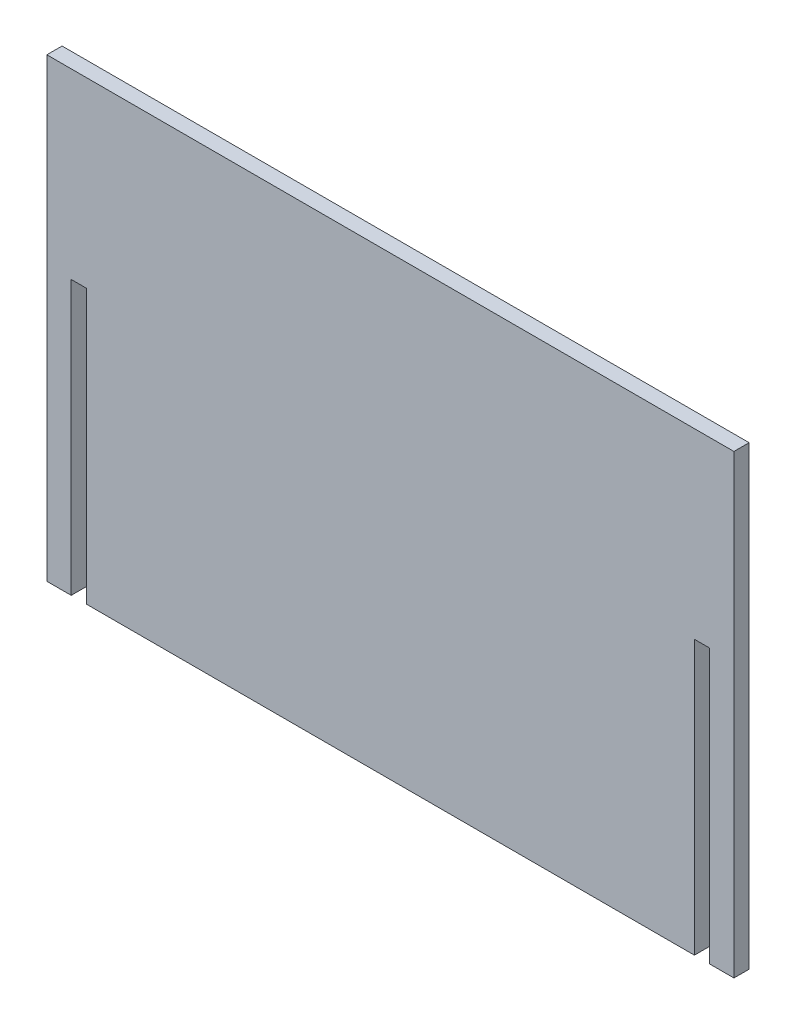
ISO-10303-21;
HEADER;
FILE_DESCRIPTION(('STEP AP214'),'2;1');
FILE_NAME('part.step','',(''),(''),'','','');
FILE_SCHEMA(('AUTOMOTIVE_DESIGN { 1 0 10303 214 1 1 1 1 }'));
ENDSEC;
DATA;
#1=APPLICATION_CONTEXT('core data for automotive mechanical design processes');
#2=APPLICATION_PROTOCOL_DEFINITION('international standard','automotive_design',2000,#1);
#3=PRODUCT_CONTEXT('',#1,'mechanical');
#4=PRODUCT('Part','Part','',(#3));
#5=PRODUCT_RELATED_PRODUCT_CATEGORY('part','',(#4));
#6=PRODUCT_DEFINITION_FORMATION('','',#4);
#7=PRODUCT_DEFINITION_CONTEXT('part definition',#1,'design');
#8=PRODUCT_DEFINITION('design','',#6,#7);
#9=PRODUCT_DEFINITION_SHAPE('','',#8);
#10=(LENGTH_UNIT() NAMED_UNIT(*) SI_UNIT(.MILLI.,.METRE.));
#11=(NAMED_UNIT(*) PLANE_ANGLE_UNIT() SI_UNIT($,.RADIAN.));
#12=(NAMED_UNIT(*) SI_UNIT($,.STERADIAN.) SOLID_ANGLE_UNIT());
#13=UNCERTAINTY_MEASURE_WITH_UNIT(LENGTH_MEASURE(1.E-05),#10,'distance_accuracy_value','');
#14=(GEOMETRIC_REPRESENTATION_CONTEXT(3) GLOBAL_UNCERTAINTY_ASSIGNED_CONTEXT((#13)) GLOBAL_UNIT_ASSIGNED_CONTEXT((#10,
#11,#12)) REPRESENTATION_CONTEXT('',''));
#15=CARTESIAN_POINT('',(0.,0.,0.));
#16=DIRECTION('',(0.,0.,1.));
#17=DIRECTION('',(1.,0.,0.));
#18=AXIS2_PLACEMENT_3D('',#15,#16,#17);
#19=CARTESIAN_POINT('',(8.,0.,5.));
#20=DIRECTION('',(0.,-1.,0.));
#21=DIRECTION('',(0.,0.,-1.));
#22=AXIS2_PLACEMENT_3D('',#19,#20,#21);
#23=PLANE('',#22);
#24=DIRECTION('',(-1.,0.,0.));
#25=VECTOR('',#24,1.);
#26=CARTESIAN_POINT('',(8.,0.,0.));
#27=LINE('',#26,#25);
#28=CARTESIAN_POINT('',(8.,0.,0.));
#29=VERTEX_POINT('',#28);
#30=CARTESIAN_POINT('',(0.,0.,0.));
#31=VERTEX_POINT('',#30);
#32=EDGE_CURVE('E154',#29,#31,#27,.T.);
#33=ORIENTED_EDGE('',*,*,#32,.F.);
#34=DIRECTION('',(0.,0.,-1.));
#35=VECTOR('',#34,1.);
#36=CARTESIAN_POINT('',(8.,0.,5.));
#37=LINE('',#36,#35);
#38=CARTESIAN_POINT('',(8.,0.,5.));
#39=VERTEX_POINT('',#38);
#40=EDGE_CURVE('E11',#39,#29,#37,.T.);
#41=ORIENTED_EDGE('',*,*,#40,.F.);
#42=DIRECTION('',(-1.,0.,0.));
#43=VECTOR('',#42,1.);
#44=CARTESIAN_POINT('',(8.,0.,5.));
#45=LINE('',#44,#43);
#46=CARTESIAN_POINT('',(0.,0.,5.));
#47=VERTEX_POINT('',#46);
#48=EDGE_CURVE('E186',#39,#47,#45,.T.);
#49=ORIENTED_EDGE('',*,*,#48,.T.);
#50=DIRECTION('',(0.,0.,-1.));
#51=VECTOR('',#50,1.);
#52=CARTESIAN_POINT('',(0.,0.,5.));
#53=LINE('',#52,#51);
#54=EDGE_CURVE('E36',#47,#31,#53,.T.);
#55=ORIENTED_EDGE('',*,*,#54,.T.);
#56=EDGE_LOOP('',(#33,#41,#49,#55));
#57=FACE_BOUND('',#56,.T.);
#58=ADVANCED_FACE('F33',(#57),#23,.T.);
#59=CARTESIAN_POINT('',(7.99999999999999,90.,5.));
#60=DIRECTION('',(1.,0.,0.));
#61=DIRECTION('',(0.,1.,0.));
#62=AXIS2_PLACEMENT_3D('',#59,#60,#61);
#63=PLANE('',#62);
#64=DIRECTION('',(0.,-1.,0.));
#65=VECTOR('',#64,1.);
#66=CARTESIAN_POINT('',(7.99999999999999,90.,0.));
#67=LINE('',#66,#65);
#68=CARTESIAN_POINT('',(7.99999999999999,90.,0.));
#69=VERTEX_POINT('',#68);
#70=EDGE_CURVE('E184',#69,#29,#67,.T.);
#71=ORIENTED_EDGE('',*,*,#70,.F.);
#72=DIRECTION('',(0.,0.,-1.));
#73=VECTOR('',#72,1.);
#74=CARTESIAN_POINT('',(7.99999999999999,90.,5.));
#75=LINE('',#74,#73);
#76=CARTESIAN_POINT('',(7.99999999999999,90.,5.));
#77=VERTEX_POINT('',#76);
#78=EDGE_CURVE('E42',#77,#69,#75,.T.);
#79=ORIENTED_EDGE('',*,*,#78,.F.);
#80=DIRECTION('',(0.,-1.,0.));
#81=VECTOR('',#80,1.);
#82=CARTESIAN_POINT('',(7.99999999999999,90.,5.));
#83=LINE('',#82,#81);
#84=EDGE_CURVE('E144',#77,#39,#83,.T.);
#85=ORIENTED_EDGE('',*,*,#84,.T.);
#86=ORIENTED_EDGE('',*,*,#40,.T.);
#87=EDGE_LOOP('',(#71,#79,#85,#86));
#88=FACE_BOUND('',#87,.T.);
#89=ADVANCED_FACE('F206',(#88),#63,.T.);
#90=CARTESIAN_POINT('',(13.,90.,5.));
#91=DIRECTION('',(0.,-1.,0.));
#92=DIRECTION('',(0.,0.,-1.));
#93=AXIS2_PLACEMENT_3D('',#90,#91,#92);
#94=PLANE('',#93);
#95=DIRECTION('',(-1.,0.,0.));
#96=VECTOR('',#95,1.);
#97=CARTESIAN_POINT('',(13.,90.,0.));
#98=LINE('',#97,#96);
#99=CARTESIAN_POINT('',(13.,90.,0.));
#100=VERTEX_POINT('',#99);
#101=EDGE_CURVE('E131',#100,#69,#98,.T.);
#102=ORIENTED_EDGE('',*,*,#101,.F.);
#103=DIRECTION('',(0.,0.,-1.));
#104=VECTOR('',#103,1.);
#105=CARTESIAN_POINT('',(13.,90.,5.));
#106=LINE('',#105,#104);
#107=CARTESIAN_POINT('',(13.,90.,5.));
#108=VERTEX_POINT('',#107);
#109=EDGE_CURVE('E126',#108,#100,#106,.T.);
#110=ORIENTED_EDGE('',*,*,#109,.F.);
#111=DIRECTION('',(-1.,0.,0.));
#112=VECTOR('',#111,1.);
#113=CARTESIAN_POINT('',(13.,90.,5.));
#114=LINE('',#113,#112);
#115=EDGE_CURVE('E129',#108,#77,#114,.T.);
#116=ORIENTED_EDGE('',*,*,#115,.T.);
#117=ORIENTED_EDGE('',*,*,#78,.T.);
#118=EDGE_LOOP('',(#102,#110,#116,#117));
#119=FACE_BOUND('',#118,.T.);
#120=ADVANCED_FACE('F128',(#119),#94,.T.);
#121=CARTESIAN_POINT('',(13.,0.,5.));
#122=DIRECTION('',(-1.,0.,0.));
#123=DIRECTION('',(0.,-1.,0.));
#124=AXIS2_PLACEMENT_3D('',#121,#122,#123);
#125=PLANE('',#124);
#126=DIRECTION('',(0.,1.,0.));
#127=VECTOR('',#126,1.);
#128=CARTESIAN_POINT('',(13.,0.,0.));
#129=LINE('',#128,#127);
#130=CARTESIAN_POINT('',(13.,0.,0.));
#131=VERTEX_POINT('',#130);
#132=EDGE_CURVE('E181',#131,#100,#129,.T.);
#133=ORIENTED_EDGE('',*,*,#132,.F.);
#134=DIRECTION('',(0.,0.,-1.));
#135=VECTOR('',#134,1.);
#136=CARTESIAN_POINT('',(13.,0.,5.));
#137=LINE('',#136,#135);
#138=CARTESIAN_POINT('',(13.,0.,5.));
#139=VERTEX_POINT('',#138);
#140=EDGE_CURVE('E136',#139,#131,#137,.T.);
#141=ORIENTED_EDGE('',*,*,#140,.F.);
#142=DIRECTION('',(0.,1.,0.));
#143=VECTOR('',#142,1.);
#144=CARTESIAN_POINT('',(13.,0.,5.));
#145=LINE('',#144,#143);
#146=EDGE_CURVE('E142',#139,#108,#145,.T.);
#147=ORIENTED_EDGE('',*,*,#146,.T.);
#148=ORIENTED_EDGE('',*,*,#109,.T.);
#149=EDGE_LOOP('',(#133,#141,#147,#148));
#150=FACE_BOUND('',#149,.T.);
#151=ADVANCED_FACE('F146',(#150),#125,.T.);
#152=CARTESIAN_POINT('',(213.,0.,5.));
#153=DIRECTION('',(0.,-1.,0.));
#154=DIRECTION('',(1.,0.,0.));
#155=AXIS2_PLACEMENT_3D('',#152,#153,#154);
#156=PLANE('',#155);
#157=DIRECTION('',(-1.,0.,0.));
#158=VECTOR('',#157,1.);
#159=CARTESIAN_POINT('',(213.,0.,0.));
#160=LINE('',#159,#158);
#161=CARTESIAN_POINT('',(213.,0.,0.));
#162=VERTEX_POINT('',#161);
#163=EDGE_CURVE('E178',#162,#131,#160,.T.);
#164=ORIENTED_EDGE('',*,*,#163,.F.);
#165=DIRECTION('',(0.,0.,-1.));
#166=VECTOR('',#165,1.);
#167=CARTESIAN_POINT('',(213.,0.,5.));
#168=LINE('',#167,#166);
#169=CARTESIAN_POINT('',(213.,0.,5.));
#170=VERTEX_POINT('',#169);
#171=EDGE_CURVE('E190',#170,#162,#168,.T.);
#172=ORIENTED_EDGE('',*,*,#171,.F.);
#173=DIRECTION('',(-1.,0.,0.));
#174=VECTOR('',#173,1.);
#175=CARTESIAN_POINT('',(213.,0.,5.));
#176=LINE('',#175,#174);
#177=EDGE_CURVE('E147',#170,#139,#176,.T.);
#178=ORIENTED_EDGE('',*,*,#177,.T.);
#179=ORIENTED_EDGE('',*,*,#140,.T.);
#180=EDGE_LOOP('',(#164,#172,#178,#179));
#181=FACE_BOUND('',#180,.T.);
#182=ADVANCED_FACE('F219',(#181),#156,.T.);
#183=CARTESIAN_POINT('',(213.,90.,5.));
#184=DIRECTION('',(1.,0.,0.));
#185=DIRECTION('',(0.,0.,-1.));
#186=AXIS2_PLACEMENT_3D('',#183,#184,#185);
#187=PLANE('',#186);
#188=DIRECTION('',(0.,-1.,0.));
#189=VECTOR('',#188,1.);
#190=CARTESIAN_POINT('',(213.,90.,0.));
#191=LINE('',#190,#189);
#192=CARTESIAN_POINT('',(213.,90.,0.));
#193=VERTEX_POINT('',#192);
#194=EDGE_CURVE('E175',#193,#162,#191,.T.);
#195=ORIENTED_EDGE('',*,*,#194,.F.);
#196=DIRECTION('',(0.,0.,-1.));
#197=VECTOR('',#196,1.);
#198=CARTESIAN_POINT('',(213.,90.,5.));
#199=LINE('',#198,#197);
#200=CARTESIAN_POINT('',(213.,90.,5.));
#201=VERTEX_POINT('',#200);
#202=EDGE_CURVE('E192',#201,#193,#199,.T.);
#203=ORIENTED_EDGE('',*,*,#202,.F.);
#204=DIRECTION('',(0.,-1.,0.));
#205=VECTOR('',#204,1.);
#206=CARTESIAN_POINT('',(213.,90.,5.));
#207=LINE('',#206,#205);
#208=EDGE_CURVE('E149',#201,#170,#207,.T.);
#209=ORIENTED_EDGE('',*,*,#208,.T.);
#210=ORIENTED_EDGE('',*,*,#171,.T.);
#211=EDGE_LOOP('',(#195,#203,#209,#210));
#212=FACE_BOUND('',#211,.T.);
#213=ADVANCED_FACE('F222',(#212),#187,.T.);
#214=CARTESIAN_POINT('',(218.,90.,5.));
#215=DIRECTION('',(0.,-1.,0.));
#216=DIRECTION('',(1.,0.,0.));
#217=AXIS2_PLACEMENT_3D('',#214,#215,#216);
#218=PLANE('',#217);
#219=DIRECTION('',(-1.,0.,0.));
#220=VECTOR('',#219,1.);
#221=CARTESIAN_POINT('',(218.,90.,0.));
#222=LINE('',#221,#220);
#223=CARTESIAN_POINT('',(218.,90.,0.));
#224=VERTEX_POINT('',#223);
#225=EDGE_CURVE('E172',#224,#193,#222,.T.);
#226=ORIENTED_EDGE('',*,*,#225,.F.);
#227=DIRECTION('',(0.,0.,-1.));
#228=VECTOR('',#227,1.);
#229=CARTESIAN_POINT('',(218.,90.,5.));
#230=LINE('',#229,#228);
#231=CARTESIAN_POINT('',(218.,90.,5.));
#232=VERTEX_POINT('',#231);
#233=EDGE_CURVE('E194',#232,#224,#230,.T.);
#234=ORIENTED_EDGE('',*,*,#233,.F.);
#235=DIRECTION('',(-1.,0.,0.));
#236=VECTOR('',#235,1.);
#237=CARTESIAN_POINT('',(218.,90.,5.));
#238=LINE('',#237,#236);
#239=EDGE_CURVE('E348',#232,#201,#238,.T.);
#240=ORIENTED_EDGE('',*,*,#239,.T.);
#241=ORIENTED_EDGE('',*,*,#202,.T.);
#242=EDGE_LOOP('',(#226,#234,#240,#241));
#243=FACE_BOUND('',#242,.T.);
#244=ADVANCED_FACE('F226',(#243),#218,.T.);
#245=CARTESIAN_POINT('',(218.,0.,5.));
#246=DIRECTION('',(-1.,0.,0.));
#247=DIRECTION('',(0.,0.,1.));
#248=AXIS2_PLACEMENT_3D('',#245,#246,#247);
#249=PLANE('',#248);
#250=DIRECTION('',(0.,1.,0.));
#251=VECTOR('',#250,1.);
#252=CARTESIAN_POINT('',(218.,0.,0.));
#253=LINE('',#252,#251);
#254=CARTESIAN_POINT('',(218.,0.,0.));
#255=VERTEX_POINT('',#254);
#256=EDGE_CURVE('E169',#255,#224,#253,.T.);
#257=ORIENTED_EDGE('',*,*,#256,.F.);
#258=DIRECTION('',(0.,0.,-1.));
#259=VECTOR('',#258,1.);
#260=CARTESIAN_POINT('',(218.,0.,5.));
#261=LINE('',#260,#259);
#262=CARTESIAN_POINT('',(218.,0.,5.));
#263=VERTEX_POINT('',#262);
#264=EDGE_CURVE('E196',#263,#255,#261,.T.);
#265=ORIENTED_EDGE('',*,*,#264,.F.);
#266=DIRECTION('',(0.,1.,0.));
#267=VECTOR('',#266,1.);
#268=CARTESIAN_POINT('',(218.,0.,5.));
#269=LINE('',#268,#267);
#270=EDGE_CURVE('E352',#263,#232,#269,.T.);
#271=ORIENTED_EDGE('',*,*,#270,.T.);
#272=ORIENTED_EDGE('',*,*,#233,.T.);
#273=EDGE_LOOP('',(#257,#265,#271,#272));
#274=FACE_BOUND('',#273,.T.);
#275=ADVANCED_FACE('F230',(#274),#249,.T.);
#276=CARTESIAN_POINT('',(226.,0.,5.));
#277=DIRECTION('',(0.,-1.,0.));
#278=DIRECTION('',(1.,0.,0.));
#279=AXIS2_PLACEMENT_3D('',#276,#277,#278);
#280=PLANE('',#279);
#281=DIRECTION('',(-1.,0.,0.));
#282=VECTOR('',#281,1.);
#283=CARTESIAN_POINT('',(226.,0.,0.));
#284=LINE('',#283,#282);
#285=CARTESIAN_POINT('',(226.,0.,0.));
#286=VERTEX_POINT('',#285);
#287=EDGE_CURVE('E166',#286,#255,#284,.T.);
#288=ORIENTED_EDGE('',*,*,#287,.F.);
#289=DIRECTION('',(0.,0.,-1.));
#290=VECTOR('',#289,1.);
#291=CARTESIAN_POINT('',(226.,0.,5.));
#292=LINE('',#291,#290);
#293=CARTESIAN_POINT('',(226.,0.,5.));
#294=VERTEX_POINT('',#293);
#295=EDGE_CURVE('E198',#294,#286,#292,.T.);
#296=ORIENTED_EDGE('',*,*,#295,.F.);
#297=DIRECTION('',(-1.,0.,0.));
#298=VECTOR('',#297,1.);
#299=CARTESIAN_POINT('',(226.,0.,5.));
#300=LINE('',#299,#298);
#301=EDGE_CURVE('E341',#294,#263,#300,.T.);
#302=ORIENTED_EDGE('',*,*,#301,.T.);
#303=ORIENTED_EDGE('',*,*,#264,.T.);
#304=EDGE_LOOP('',(#288,#296,#302,#303));
#305=FACE_BOUND('',#304,.T.);
#306=ADVANCED_FACE('F234',(#305),#280,.T.);
#307=CARTESIAN_POINT('',(226.,150.,5.));
#308=DIRECTION('',(1.,0.,0.));
#309=DIRECTION('',(0.,1.,0.));
#310=AXIS2_PLACEMENT_3D('',#307,#308,#309);
#311=PLANE('',#310);
#312=DIRECTION('',(0.,-1.,0.));
#313=VECTOR('',#312,1.);
#314=CARTESIAN_POINT('',(226.,150.,0.));
#315=LINE('',#314,#313);
#316=CARTESIAN_POINT('',(226.,150.,0.));
#317=VERTEX_POINT('',#316);
#318=EDGE_CURVE('E163',#317,#286,#315,.T.);
#319=ORIENTED_EDGE('',*,*,#318,.F.);
#320=DIRECTION('',(0.,0.,-1.));
#321=VECTOR('',#320,1.);
#322=CARTESIAN_POINT('',(226.,150.,5.));
#323=LINE('',#322,#321);
#324=CARTESIAN_POINT('',(226.,150.,5.));
#325=VERTEX_POINT('',#324);
#326=EDGE_CURVE('E200',#325,#317,#323,.T.);
#327=ORIENTED_EDGE('',*,*,#326,.F.);
#328=DIRECTION('',(0.,-1.,0.));
#329=VECTOR('',#328,1.);
#330=CARTESIAN_POINT('',(226.,150.,5.));
#331=LINE('',#330,#329);
#332=EDGE_CURVE('E337',#325,#294,#331,.T.);
#333=ORIENTED_EDGE('',*,*,#332,.T.);
#334=ORIENTED_EDGE('',*,*,#295,.T.);
#335=EDGE_LOOP('',(#319,#327,#333,#334));
#336=FACE_BOUND('',#335,.T.);
#337=ADVANCED_FACE('F238',(#336),#311,.T.);
#338=CARTESIAN_POINT('',(0.,150.,5.));
#339=DIRECTION('',(0.,1.,0.));
#340=DIRECTION('',(0.,0.,1.));
#341=AXIS2_PLACEMENT_3D('',#338,#339,#340);
#342=PLANE('',#341);
#343=DIRECTION('',(1.,0.,0.));
#344=VECTOR('',#343,1.);
#345=CARTESIAN_POINT('',(0.,150.,0.));
#346=LINE('',#345,#344);
#347=CARTESIAN_POINT('',(0.,150.,0.));
#348=VERTEX_POINT('',#347);
#349=EDGE_CURVE('E160',#348,#317,#346,.T.);
#350=ORIENTED_EDGE('',*,*,#349,.F.);
#351=DIRECTION('',(0.,0.,-1.));
#352=VECTOR('',#351,1.);
#353=CARTESIAN_POINT('',(0.,150.,5.));
#354=LINE('',#353,#352);
#355=CARTESIAN_POINT('',(0.,150.,5.));
#356=VERTEX_POINT('',#355);
#357=EDGE_CURVE('E201',#356,#348,#354,.T.);
#358=ORIENTED_EDGE('',*,*,#357,.F.);
#359=DIRECTION('',(1.,0.,0.));
#360=VECTOR('',#359,1.);
#361=CARTESIAN_POINT('',(0.,150.,5.));
#362=LINE('',#361,#360);
#363=EDGE_CURVE('E358',#356,#325,#362,.T.);
#364=ORIENTED_EDGE('',*,*,#363,.T.);
#365=ORIENTED_EDGE('',*,*,#326,.T.);
#366=EDGE_LOOP('',(#350,#358,#364,#365));
#367=FACE_BOUND('',#366,.T.);
#368=ADVANCED_FACE('F242',(#367),#342,.T.);
#369=CARTESIAN_POINT('',(0.,0.,5.));
#370=DIRECTION('',(-1.,0.,0.));
#371=DIRECTION('',(0.,0.,1.));
#372=AXIS2_PLACEMENT_3D('',#369,#370,#371);
#373=PLANE('',#372);
#374=DIRECTION('',(0.,1.,0.));
#375=VECTOR('',#374,1.);
#376=CARTESIAN_POINT('',(0.,0.,0.));
#377=LINE('',#376,#375);
#378=EDGE_CURVE('E157',#31,#348,#377,.T.);
#379=ORIENTED_EDGE('',*,*,#378,.F.);
#380=ORIENTED_EDGE('',*,*,#54,.F.);
#381=DIRECTION('',(0.,1.,0.));
#382=VECTOR('',#381,1.);
#383=CARTESIAN_POINT('',(0.,0.,5.));
#384=LINE('',#383,#382);
#385=EDGE_CURVE('E360',#47,#356,#384,.T.);
#386=ORIENTED_EDGE('',*,*,#385,.T.);
#387=ORIENTED_EDGE('',*,*,#357,.T.);
#388=EDGE_LOOP('',(#379,#380,#386,#387));
#389=FACE_BOUND('',#388,.T.);
#390=ADVANCED_FACE('F203',(#389),#373,.T.);
#391=CARTESIAN_POINT('',(0.,0.,5.));
#392=DIRECTION('',(0.,0.,-1.));
#393=DIRECTION('',(-1.,0.,0.));
#394=AXIS2_PLACEMENT_3D('',#391,#392,#393);
#395=PLANE('',#394);
#396=ORIENTED_EDGE('',*,*,#48,.F.);
#397=ORIENTED_EDGE('',*,*,#84,.F.);
#398=ORIENTED_EDGE('',*,*,#115,.F.);
#399=ORIENTED_EDGE('',*,*,#146,.F.);
#400=ORIENTED_EDGE('',*,*,#177,.F.);
#401=ORIENTED_EDGE('',*,*,#208,.F.);
#402=ORIENTED_EDGE('',*,*,#239,.F.);
#403=ORIENTED_EDGE('',*,*,#270,.F.);
#404=ORIENTED_EDGE('',*,*,#301,.F.);
#405=ORIENTED_EDGE('',*,*,#332,.F.);
#406=ORIENTED_EDGE('',*,*,#363,.F.);
#407=ORIENTED_EDGE('',*,*,#385,.F.);
#408=EDGE_LOOP('',(#396,#397,#398,#399,#400,#401,#402,#403,#404,#405,#406,#407));
#409=FACE_BOUND('',#408,.T.);
#410=ADVANCED_FACE('F140',(#409),#395,.F.);
#411=CARTESIAN_POINT('',(0.,0.,0.));
#412=DIRECTION('',(0.,0.,-1.));
#413=DIRECTION('',(-1.,0.,0.));
#414=AXIS2_PLACEMENT_3D('',#411,#412,#413);
#415=PLANE('',#414);
#416=ORIENTED_EDGE('',*,*,#32,.T.);
#417=ORIENTED_EDGE('',*,*,#378,.T.);
#418=ORIENTED_EDGE('',*,*,#349,.T.);
#419=ORIENTED_EDGE('',*,*,#318,.T.);
#420=ORIENTED_EDGE('',*,*,#287,.T.);
#421=ORIENTED_EDGE('',*,*,#256,.T.);
#422=ORIENTED_EDGE('',*,*,#225,.T.);
#423=ORIENTED_EDGE('',*,*,#194,.T.);
#424=ORIENTED_EDGE('',*,*,#163,.T.);
#425=ORIENTED_EDGE('',*,*,#132,.T.);
#426=ORIENTED_EDGE('',*,*,#101,.T.);
#427=ORIENTED_EDGE('',*,*,#70,.T.);
#428=EDGE_LOOP('',(#416,#417,#418,#419,#420,#421,#422,#423,#424,#425,#426,#427));
#429=FACE_BOUND('',#428,.T.);
#430=ADVANCED_FACE('F205',(#429),#415,.T.);
#431=CLOSED_SHELL('',(#58,#89,#120,#151,#182,#213,#244,#275,#306,#337,#368,#390,#410,#430));
#432=MANIFOLD_SOLID_BREP('B2',#431);
#433=ADVANCED_BREP_SHAPE_REPRESENTATION('',(#18,#432),#14);
#434=SHAPE_DEFINITION_REPRESENTATION(#9,#433);
ENDSEC;
END-ISO-10303-21;
